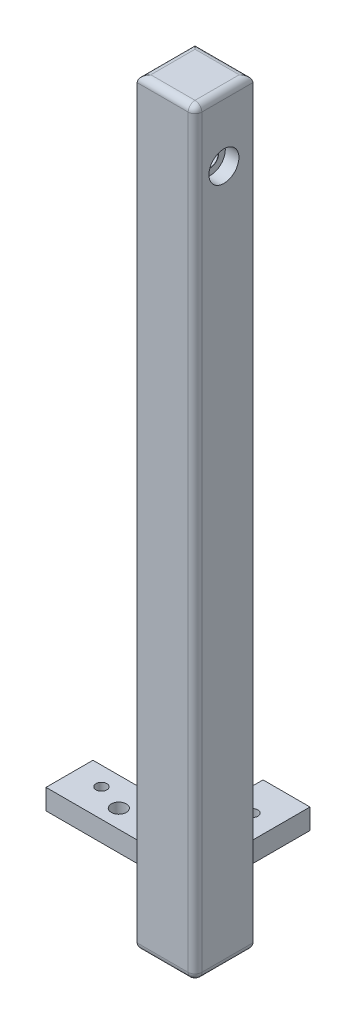
ISO-10303-21;
HEADER;
FILE_DESCRIPTION(('STEP AP214'),'2;1');
FILE_NAME('part.step','',(''),(''),'','','');
FILE_SCHEMA(('AUTOMOTIVE_DESIGN { 1 0 10303 214 1 1 1 1 }'));
ENDSEC;
DATA;
#1=APPLICATION_CONTEXT('core data for automotive mechanical design processes');
#2=APPLICATION_PROTOCOL_DEFINITION('international standard','automotive_design',2000,#1);
#3=PRODUCT_CONTEXT('',#1,'mechanical');
#4=PRODUCT('Part','Part','',(#3));
#5=PRODUCT_RELATED_PRODUCT_CATEGORY('part','',(#4));
#6=PRODUCT_DEFINITION_FORMATION('','',#4);
#7=PRODUCT_DEFINITION_CONTEXT('part definition',#1,'design');
#8=PRODUCT_DEFINITION('design','',#6,#7);
#9=PRODUCT_DEFINITION_SHAPE('','',#8);
#10=(LENGTH_UNIT() NAMED_UNIT(*) SI_UNIT(.MILLI.,.METRE.));
#11=(NAMED_UNIT(*) PLANE_ANGLE_UNIT() SI_UNIT($,.RADIAN.));
#12=(NAMED_UNIT(*) SI_UNIT($,.STERADIAN.) SOLID_ANGLE_UNIT());
#13=UNCERTAINTY_MEASURE_WITH_UNIT(LENGTH_MEASURE(1.E-05),#10,'distance_accuracy_value','');
#14=(GEOMETRIC_REPRESENTATION_CONTEXT(3) GLOBAL_UNCERTAINTY_ASSIGNED_CONTEXT((#13)) GLOBAL_UNIT_ASSIGNED_CONTEXT((#10,
#11,#12)) REPRESENTATION_CONTEXT('',''));
#15=CARTESIAN_POINT('',(0.,0.,0.));
#16=DIRECTION('',(0.,0.,1.));
#17=DIRECTION('',(1.,0.,0.));
#18=AXIS2_PLACEMENT_3D('',#15,#16,#17);
#19=CARTESIAN_POINT('',(0.,0.,0.));
#20=DIRECTION('',(0.,0.,1.));
#21=DIRECTION('',(1.,0.,0.));
#22=AXIS2_PLACEMENT_3D('',#19,#20,#21);
#23=PLANE('',#22);
#24=DIRECTION('',(0.,1.,0.));
#25=VECTOR('',#24,1.);
#26=CARTESIAN_POINT('',(0.,-99.,0.));
#27=LINE('',#26,#25);
#28=CARTESIAN_POINT('',(0.,-102.,0.));
#29=VERTEX_POINT('',#28);
#30=CARTESIAN_POINT('',(0.,-98.9999999999999,0.));
#31=VERTEX_POINT('',#30);
#32=EDGE_CURVE('E232',#29,#31,#27,.T.);
#33=ORIENTED_EDGE('',*,*,#32,.F.);
#34=DIRECTION('',(1.,0.,0.));
#35=VECTOR('',#34,1.);
#36=CARTESIAN_POINT('',(-15.,-102.,0.));
#37=LINE('',#36,#35);
#38=CARTESIAN_POINT('',(-15.,-102.,0.));
#39=VERTEX_POINT('',#38);
#40=EDGE_CURVE('E206',#39,#29,#37,.T.);
#41=ORIENTED_EDGE('',*,*,#40,.F.);
#42=DIRECTION('',(0.,-1.,0.));
#43=VECTOR('',#42,1.);
#44=CARTESIAN_POINT('',(-15.,-99.,0.));
#45=LINE('',#44,#43);
#46=CARTESIAN_POINT('',(-15.,-99.,0.));
#47=VERTEX_POINT('',#46);
#48=EDGE_CURVE('E188',#47,#39,#45,.T.);
#49=ORIENTED_EDGE('',*,*,#48,.F.);
#50=DIRECTION('',(1.,0.,0.));
#51=VECTOR('',#50,1.);
#52=CARTESIAN_POINT('',(-15.,-99.,0.));
#53=LINE('',#52,#51);
#54=EDGE_CURVE('E384',#47,#31,#53,.T.);
#55=ORIENTED_EDGE('',*,*,#54,.T.);
#56=EDGE_LOOP('',(#33,#41,#49,#55));
#57=FACE_BOUND('',#56,.T.);
#58=ADVANCED_FACE('F40',(#57),#23,.F.);
#59=CARTESIAN_POINT('',(3.45000000000001,-26.8,0.));
#60=DIRECTION('',(0.,0.,-1.));
#61=DIRECTION('',(-1.,0.,0.));
#62=AXIS2_PLACEMENT_3D('',#59,#60,#61);
#63=CIRCLE('',#62,0.999999999999989);
#64=CARTESIAN_POINT('',(2.45000000000002,-26.8,0.));
#65=VERTEX_POINT('',#64);
#66=EDGE_CURVE('E444',#65,#65,#63,.T.);
#67=ORIENTED_EDGE('',*,*,#66,.F.);
#68=EDGE_LOOP('',(#67));
#69=FACE_BOUND('',#68,.T.);
#70=CARTESIAN_POINT('',(3.45000000000001,-84.2,0.));
#71=DIRECTION('',(0.,0.,-1.));
#72=DIRECTION('',(-1.,0.,0.));
#73=AXIS2_PLACEMENT_3D('',#70,#71,#72);
#74=CIRCLE('',#73,0.999999999999989);
#75=CARTESIAN_POINT('',(2.45000000000002,-84.2,0.));
#76=VERTEX_POINT('',#75);
#77=EDGE_CURVE('E450',#76,#76,#74,.T.);
#78=ORIENTED_EDGE('',*,*,#77,.F.);
#79=EDGE_LOOP('',(#78));
#80=FACE_BOUND('',#79,.T.);
#81=CARTESIAN_POINT('',(3.45,-31.1,0.));
#82=DIRECTION('',(0.,0.,-1.));
#83=DIRECTION('',(-1.,0.,0.));
#84=AXIS2_PLACEMENT_3D('',#81,#82,#83);
#85=CIRCLE('',#84,0.999999999999989);
#86=CARTESIAN_POINT('',(2.45000000000002,-31.1,0.));
#87=VERTEX_POINT('',#86);
#88=EDGE_CURVE('E456',#87,#87,#85,.T.);
#89=ORIENTED_EDGE('',*,*,#88,.F.);
#90=EDGE_LOOP('',(#89));
#91=FACE_BOUND('',#90,.T.);
#92=CARTESIAN_POINT('',(3.45000000000001,-79.9,0.));
#93=DIRECTION('',(0.,0.,-1.));
#94=DIRECTION('',(-1.,0.,0.));
#95=AXIS2_PLACEMENT_3D('',#92,#93,#94);
#96=CIRCLE('',#95,0.999999999999989);
#97=CARTESIAN_POINT('',(2.45000000000002,-79.9,0.));
#98=VERTEX_POINT('',#97);
#99=EDGE_CURVE('E462',#98,#98,#96,.T.);
#100=ORIENTED_EDGE('',*,*,#99,.F.);
#101=EDGE_LOOP('',(#100));
#102=FACE_BOUND('',#101,.T.);
#103=DIRECTION('',(0.,-1.,0.));
#104=VECTOR('',#103,1.);
#105=CARTESIAN_POINT('',(0.,0.,0.));
#106=LINE('',#105,#104);
#107=CARTESIAN_POINT('',(0.,-1.,0.));
#108=VERTEX_POINT('',#107);
#109=EDGE_CURVE('E186',#108,#31,#106,.T.);
#110=ORIENTED_EDGE('',*,*,#109,.F.);
#111=DIRECTION('',(-1.,0.,0.));
#112=VECTOR('',#111,1.);
#113=CARTESIAN_POINT('',(0.,-1.,0.));
#114=LINE('',#113,#112);
#115=CARTESIAN_POINT('',(8.50000000000001,-1.,0.));
#116=VERTEX_POINT('',#115);
#117=EDGE_CURVE('E248',#108,#116,#114,.F.);
#118=ORIENTED_EDGE('',*,*,#117,.T.);
#119=DIRECTION('',(0.,-1.,0.));
#120=VECTOR('',#119,1.);
#121=CARTESIAN_POINT('',(8.50000000000001,0.,0.));
#122=LINE('',#121,#120);
#123=CARTESIAN_POINT('',(8.50000000000001,-110.5,0.));
#124=VERTEX_POINT('',#123);
#125=EDGE_CURVE('E215',#116,#124,#122,.T.);
#126=ORIENTED_EDGE('',*,*,#125,.T.);
#127=DIRECTION('',(1.,0.,0.));
#128=VECTOR('',#127,1.);
#129=CARTESIAN_POINT('',(0.,-110.5,0.));
#130=LINE('',#129,#128);
#131=CARTESIAN_POINT('',(0.,-110.5,0.));
#132=VERTEX_POINT('',#131);
#133=EDGE_CURVE('E302',#124,#132,#130,.F.);
#134=ORIENTED_EDGE('',*,*,#133,.T.);
#135=EDGE_CURVE('E224',#29,#132,#106,.T.);
#136=ORIENTED_EDGE('',*,*,#135,.F.);
#137=DIRECTION('',(-1.,0.,0.));
#138=VECTOR('',#137,1.);
#139=CARTESIAN_POINT('',(0.,-102.,0.));
#140=LINE('',#139,#138);
#141=CARTESIAN_POINT('',(6.90000000000001,-102.,0.));
#142=VERTEX_POINT('',#141);
#143=EDGE_CURVE('E231',#142,#29,#140,.T.);
#144=ORIENTED_EDGE('',*,*,#143,.F.);
#145=DIRECTION('',(0.,1.,0.));
#146=VECTOR('',#145,1.);
#147=CARTESIAN_POINT('',(6.90000000000001,-109.,0.));
#148=LINE('',#147,#146);
#149=CARTESIAN_POINT('',(6.90000000000001,-99.,0.));
#150=VERTEX_POINT('',#149);
#151=EDGE_CURVE('E434',#142,#150,#148,.T.);
#152=ORIENTED_EDGE('',*,*,#151,.T.);
#153=DIRECTION('',(1.,0.,0.));
#154=VECTOR('',#153,1.);
#155=CARTESIAN_POINT('',(0.,-99.,0.));
#156=LINE('',#155,#154);
#157=EDGE_CURVE('E227',#31,#150,#156,.T.);
#158=ORIENTED_EDGE('',*,*,#157,.F.);
#159=EDGE_LOOP('',(#110,#118,#126,#134,#136,#144,#152,#158));
#160=FACE_BOUND('',#159,.T.);
#161=ADVANCED_FACE('F395',(#69,#80,#91,#102,#160),#23,.F.);
#162=CARTESIAN_POINT('',(0.,0.,8.5));
#163=DIRECTION('',(1.,0.,0.));
#164=DIRECTION('',(0.,1.,0.));
#165=AXIS2_PLACEMENT_3D('',#162,#163,#164);
#166=PLANE('',#165);
#167=DIRECTION('',(0.,1.,0.));
#168=VECTOR('',#167,1.);
#169=CARTESIAN_POINT('',(0.,-109.,6.9));
#170=LINE('',#169,#168);
#171=CARTESIAN_POINT('',(0.,-102.,6.9));
#172=VERTEX_POINT('',#171);
#173=CARTESIAN_POINT('',(0.,-99.,6.9));
#174=VERTEX_POINT('',#173);
#175=EDGE_CURVE('E167',#172,#174,#170,.T.);
#176=ORIENTED_EDGE('',*,*,#175,.F.);
#177=DIRECTION('',(0.,0.,1.));
#178=VECTOR('',#177,1.);
#179=CARTESIAN_POINT('',(0.,-102.,0.));
#180=LINE('',#179,#178);
#181=EDGE_CURVE('E189',#29,#172,#180,.T.);
#182=ORIENTED_EDGE('',*,*,#181,.F.);
#183=ORIENTED_EDGE('',*,*,#135,.T.);
#184=DIRECTION('',(0.,0.,-1.));
#185=VECTOR('',#184,1.);
#186=CARTESIAN_POINT('',(0.,-110.5,8.5));
#187=LINE('',#186,#185);
#188=CARTESIAN_POINT('',(0.,-110.5,8.5));
#189=VERTEX_POINT('',#188);
#190=EDGE_CURVE('E318',#132,#189,#187,.F.);
#191=ORIENTED_EDGE('',*,*,#190,.T.);
#192=DIRECTION('',(0.,-1.,0.));
#193=VECTOR('',#192,1.);
#194=CARTESIAN_POINT('',(0.,0.,8.5));
#195=LINE('',#194,#193);
#196=CARTESIAN_POINT('',(0.,-1.,8.5));
#197=VERTEX_POINT('',#196);
#198=EDGE_CURVE('E203',#197,#189,#195,.T.);
#199=ORIENTED_EDGE('',*,*,#198,.F.);
#200=DIRECTION('',(0.,0.,-1.));
#201=VECTOR('',#200,1.);
#202=CARTESIAN_POINT('',(0.,-1.,8.5));
#203=LINE('',#202,#201);
#204=EDGE_CURVE('E287',#197,#108,#203,.T.);
#205=ORIENTED_EDGE('',*,*,#204,.T.);
#206=ORIENTED_EDGE('',*,*,#109,.T.);
#207=DIRECTION('',(0.,0.,-1.));
#208=VECTOR('',#207,1.);
#209=CARTESIAN_POINT('',(0.,-99.,0.));
#210=LINE('',#209,#208);
#211=EDGE_CURVE('E44',#174,#31,#210,.T.);
#212=ORIENTED_EDGE('',*,*,#211,.F.);
#213=EDGE_LOOP('',(#176,#182,#183,#191,#199,#205,#206,#212));
#214=FACE_BOUND('',#213,.T.);
#215=CARTESIAN_POINT('',(0.,-9.5,4.25));
#216=DIRECTION('',(1.,0.,0.));
#217=DIRECTION('',(0.,1.,0.));
#218=AXIS2_PLACEMENT_3D('',#215,#216,#217);
#219=CIRCLE('',#218,1.2);
#220=CARTESIAN_POINT('',(0.,-8.3,4.25));
#221=VERTEX_POINT('',#220);
#222=EDGE_CURVE('E333',#221,#221,#219,.T.);
#223=ORIENTED_EDGE('',*,*,#222,.T.);
#224=EDGE_LOOP('',(#223));
#225=FACE_BOUND('',#224,.T.);
#226=ADVANCED_FACE('F183',(#214,#225),#166,.F.);
#227=CARTESIAN_POINT('',(8.50000000000001,0.,8.5));
#228=DIRECTION('',(1.,0.,0.));
#229=DIRECTION('',(0.,1.,0.));
#230=AXIS2_PLACEMENT_3D('',#227,#228,#229);
#231=PLANE('',#230);
#232=ORIENTED_EDGE('',*,*,#125,.F.);
#233=DIRECTION('',(0.,0.,-1.));
#234=VECTOR('',#233,1.);
#235=CARTESIAN_POINT('',(8.50000000000001,-1.,8.5));
#236=LINE('',#235,#234);
#237=CARTESIAN_POINT('',(8.50000000000001,-1.,7.5));
#238=VERTEX_POINT('',#237);
#239=EDGE_CURVE('E307',#116,#238,#236,.F.);
#240=ORIENTED_EDGE('',*,*,#239,.T.);
#241=DIRECTION('',(0.,-1.,0.));
#242=VECTOR('',#241,1.);
#243=CARTESIAN_POINT('',(8.50000000000001,0.,7.5));
#244=LINE('',#243,#242);
#245=CARTESIAN_POINT('',(8.50000000000001,-110.5,7.5));
#246=VERTEX_POINT('',#245);
#247=EDGE_CURVE('E309',#238,#246,#244,.T.);
#248=ORIENTED_EDGE('',*,*,#247,.T.);
#249=DIRECTION('',(0.,0.,-1.));
#250=VECTOR('',#249,1.);
#251=CARTESIAN_POINT('',(8.50000000000001,-110.5,0.));
#252=LINE('',#251,#250);
#253=EDGE_CURVE('E304',#246,#124,#252,.T.);
#254=ORIENTED_EDGE('',*,*,#253,.T.);
#255=EDGE_LOOP('',(#232,#240,#248,#254));
#256=FACE_BOUND('',#255,.T.);
#257=CARTESIAN_POINT('',(8.50000000000001,-9.5,4.25));
#258=DIRECTION('',(1.,0.,0.));
#259=DIRECTION('',(0.,0.,-1.));
#260=AXIS2_PLACEMENT_3D('',#257,#258,#259);
#261=CIRCLE('',#260,2.2);
#262=CARTESIAN_POINT('',(8.50000000000001,-9.5,2.05));
#263=VERTEX_POINT('',#262);
#264=EDGE_CURVE('E252',#263,#263,#261,.T.);
#265=ORIENTED_EDGE('',*,*,#264,.F.);
#266=EDGE_LOOP('',(#265));
#267=FACE_BOUND('',#266,.T.);
#268=ADVANCED_FACE('F498',(#256,#267),#231,.T.);
#269=CARTESIAN_POINT('',(8.50000000000001,0.,8.5));
#270=DIRECTION('',(0.,-1.,0.));
#271=DIRECTION('',(1.,0.,0.));
#272=AXIS2_PLACEMENT_3D('',#269,#270,#271);
#273=PLANE('',#272);
#274=DIRECTION('',(-1.,0.,0.));
#275=VECTOR('',#274,1.);
#276=CARTESIAN_POINT('',(8.50000000000001,0.,7.5));
#277=LINE('',#276,#275);
#278=CARTESIAN_POINT('',(1.,0.,7.5));
#279=VERTEX_POINT('',#278);
#280=CARTESIAN_POINT('',(7.50000000000001,0.,7.5));
#281=VERTEX_POINT('',#280);
#282=EDGE_CURVE('E293',#279,#281,#277,.F.);
#283=ORIENTED_EDGE('',*,*,#282,.T.);
#284=DIRECTION('',(0.,0.,-1.));
#285=VECTOR('',#284,1.);
#286=CARTESIAN_POINT('',(7.50000000000001,0.,0.));
#287=LINE('',#286,#285);
#288=CARTESIAN_POINT('',(7.50000000000001,0.,1.));
#289=VERTEX_POINT('',#288);
#290=EDGE_CURVE('E289',#281,#289,#287,.T.);
#291=ORIENTED_EDGE('',*,*,#290,.T.);
#292=DIRECTION('',(-1.,0.,0.));
#293=VECTOR('',#292,1.);
#294=CARTESIAN_POINT('',(8.50000000000001,0.,1.));
#295=LINE('',#294,#293);
#296=CARTESIAN_POINT('',(1.,0.,1.));
#297=VERTEX_POINT('',#296);
#298=EDGE_CURVE('E297',#289,#297,#295,.T.);
#299=ORIENTED_EDGE('',*,*,#298,.T.);
#300=DIRECTION('',(0.,0.,-1.));
#301=VECTOR('',#300,1.);
#302=CARTESIAN_POINT('',(1.,0.,8.5));
#303=LINE('',#302,#301);
#304=EDGE_CURVE('E295',#297,#279,#303,.F.);
#305=ORIENTED_EDGE('',*,*,#304,.T.);
#306=EDGE_LOOP('',(#283,#291,#299,#305));
#307=FACE_BOUND('',#306,.T.);
#308=ADVANCED_FACE('F424',(#307),#273,.F.);
#309=CARTESIAN_POINT('',(0.,-111.5,8.5));
#310=DIRECTION('',(0.,1.,0.));
#311=DIRECTION('',(0.,0.,1.));
#312=AXIS2_PLACEMENT_3D('',#309,#310,#311);
#313=PLANE('',#312);
#314=DIRECTION('',(1.,0.,0.));
#315=VECTOR('',#314,1.);
#316=CARTESIAN_POINT('',(0.,-111.5,7.5));
#317=LINE('',#316,#315);
#318=CARTESIAN_POINT('',(7.50000000000001,-111.5,7.5));
#319=VERTEX_POINT('',#318);
#320=CARTESIAN_POINT('',(1.00000000000001,-111.5,7.5));
#321=VERTEX_POINT('',#320);
#322=EDGE_CURVE('E324',#319,#321,#317,.F.);
#323=ORIENTED_EDGE('',*,*,#322,.T.);
#324=DIRECTION('',(0.,0.,-1.));
#325=VECTOR('',#324,1.);
#326=CARTESIAN_POINT('',(1.00000000000001,-111.5,8.5));
#327=LINE('',#326,#325);
#328=CARTESIAN_POINT('',(1.00000000000001,-111.5,1.));
#329=VERTEX_POINT('',#328);
#330=EDGE_CURVE('E321',#321,#329,#327,.T.);
#331=ORIENTED_EDGE('',*,*,#330,.T.);
#332=DIRECTION('',(1.,0.,0.));
#333=VECTOR('',#332,1.);
#334=CARTESIAN_POINT('',(0.,-111.5,1.));
#335=LINE('',#334,#333);
#336=CARTESIAN_POINT('',(7.50000000000001,-111.5,1.));
#337=VERTEX_POINT('',#336);
#338=EDGE_CURVE('E328',#329,#337,#335,.T.);
#339=ORIENTED_EDGE('',*,*,#338,.T.);
#340=DIRECTION('',(0.,0.,-1.));
#341=VECTOR('',#340,1.);
#342=CARTESIAN_POINT('',(7.50000000000001,-111.5,8.5));
#343=LINE('',#342,#341);
#344=EDGE_CURVE('E326',#337,#319,#343,.F.);
#345=ORIENTED_EDGE('',*,*,#344,.T.);
#346=EDGE_LOOP('',(#323,#331,#339,#345));
#347=FACE_BOUND('',#346,.T.);
#348=CARTESIAN_POINT('',(4.25000000000001,-111.5,4.25));
#349=DIRECTION('',(0.,1.,0.));
#350=DIRECTION('',(0.,0.,1.));
#351=AXIS2_PLACEMENT_3D('',#348,#349,#350);
#352=CIRCLE('',#351,3.09999999999999);
#353=CARTESIAN_POINT('',(4.25000000000001,-111.5,7.34999999999999));
#354=VERTEX_POINT('',#353);
#355=EDGE_CURVE('E330',#354,#354,#352,.T.);
#356=ORIENTED_EDGE('',*,*,#355,.T.);
#357=EDGE_LOOP('',(#356));
#358=FACE_BOUND('',#357,.T.);
#359=ADVANCED_FACE('F506',(#347,#358),#313,.F.);
#360=CARTESIAN_POINT('',(0.,0.,8.5));
#361=DIRECTION('',(0.,0.,1.));
#362=DIRECTION('',(1.,0.,0.));
#363=AXIS2_PLACEMENT_3D('',#360,#361,#362);
#364=PLANE('',#363);
#365=DIRECTION('',(-1.,0.,0.));
#366=VECTOR('',#365,1.);
#367=CARTESIAN_POINT('',(0.,-1.,8.5));
#368=LINE('',#367,#366);
#369=CARTESIAN_POINT('',(7.50000000000001,-1.,8.5));
#370=VERTEX_POINT('',#369);
#371=EDGE_CURVE('E313',#370,#197,#368,.T.);
#372=ORIENTED_EDGE('',*,*,#371,.T.);
#373=ORIENTED_EDGE('',*,*,#198,.T.);
#374=DIRECTION('',(1.,0.,0.));
#375=VECTOR('',#374,1.);
#376=CARTESIAN_POINT('',(8.50000000000001,-110.5,8.5));
#377=LINE('',#376,#375);
#378=CARTESIAN_POINT('',(7.50000000000001,-110.5,8.5));
#379=VERTEX_POINT('',#378);
#380=EDGE_CURVE('E311',#189,#379,#377,.T.);
#381=ORIENTED_EDGE('',*,*,#380,.T.);
#382=DIRECTION('',(0.,-1.,0.));
#383=VECTOR('',#382,1.);
#384=CARTESIAN_POINT('',(7.50000000000001,0.,8.5));
#385=LINE('',#384,#383);
#386=EDGE_CURVE('E316',#379,#370,#385,.F.);
#387=ORIENTED_EDGE('',*,*,#386,.T.);
#388=EDGE_LOOP('',(#372,#373,#381,#387));
#389=FACE_BOUND('',#388,.T.);
#390=ADVANCED_FACE('F410',(#389),#364,.T.);
#391=CARTESIAN_POINT('',(4.25000000000001,-91.5,4.25));
#392=DIRECTION('',(0.,-1.,0.));
#393=DIRECTION('',(0.,0.,-1.));
#394=AXIS2_PLACEMENT_3D('',#391,#392,#393);
#395=CONICAL_SURFACE('',#394,2.1,1.02974425867666);
#396=CARTESIAN_POINT('',(4.25000000000001,-90.2381927000421,4.25));
#397=VERTEX_POINT('',#396);
#398=VERTEX_LOOP('',#397);
#399=FACE_BOUND('',#398,.T.);
#400=CARTESIAN_POINT('',(4.25000000000001,-91.5,4.25));
#401=DIRECTION('',(0.,-1.,0.));
#402=DIRECTION('',(0.,0.,-1.));
#403=AXIS2_PLACEMENT_3D('',#400,#401,#402);
#404=CIRCLE('',#403,2.1);
#405=CARTESIAN_POINT('',(4.25000000000001,-91.5,2.15));
#406=VERTEX_POINT('',#405);
#407=EDGE_CURVE('E213',#406,#406,#404,.T.);
#408=ORIENTED_EDGE('',*,*,#407,.T.);
#409=EDGE_LOOP('',(#408));
#410=FACE_BOUND('',#409,.T.);
#411=ADVANCED_FACE('F524',(#399,#410),#395,.F.);
#412=CARTESIAN_POINT('',(4.25000000000001,-111.5,4.25));
#413=DIRECTION('',(0.,-1.,0.));
#414=DIRECTION('',(0.,0.,-1.));
#415=AXIS2_PLACEMENT_3D('',#412,#413,#414);
#416=CYLINDRICAL_SURFACE('',#415,2.09999999999999);
#417=CARTESIAN_POINT('',(4.25000000000001,-110.5,4.25));
#418=DIRECTION('',(0.,1.,0.));
#419=DIRECTION('',(0.,0.,1.));
#420=AXIS2_PLACEMENT_3D('',#417,#418,#419);
#421=CIRCLE('',#420,2.09999999999999);
#422=CARTESIAN_POINT('',(4.25000000000001,-110.5,6.34999999999999));
#423=VERTEX_POINT('',#422);
#424=EDGE_CURVE('E299',#423,#423,#421,.F.);
#425=ORIENTED_EDGE('',*,*,#424,.T.);
#426=EDGE_LOOP('',(#425));
#427=FACE_BOUND('',#426,.T.);
#428=ORIENTED_EDGE('',*,*,#407,.F.);
#429=EDGE_LOOP('',(#428));
#430=FACE_BOUND('',#429,.T.);
#431=ADVANCED_FACE('F534',(#427,#430),#416,.F.);
#432=CARTESIAN_POINT('',(-15.,-102.,0.));
#433=DIRECTION('',(0.,1.,0.));
#434=DIRECTION('',(-1.,0.,0.));
#435=AXIS2_PLACEMENT_3D('',#432,#433,#434);
#436=PLANE('',#435);
#437=CARTESIAN_POINT('',(-11.,-102.,2.75));
#438=DIRECTION('',(0.,1.,0.));
#439=DIRECTION('',(-1.,0.,0.));
#440=AXIS2_PLACEMENT_3D('',#437,#438,#439);
#441=CIRCLE('',#440,0.799999999999999);
#442=CARTESIAN_POINT('',(-11.8,-102.,2.75));
#443=VERTEX_POINT('',#442);
#444=EDGE_CURVE('E374',#443,#443,#441,.T.);
#445=ORIENTED_EDGE('',*,*,#444,.T.);
#446=EDGE_LOOP('',(#445));
#447=FACE_BOUND('',#446,.T.);
#448=CARTESIAN_POINT('',(-6.99999999999999,-102.,4.2));
#449=DIRECTION('',(0.,1.,0.));
#450=DIRECTION('',(-1.,0.,0.));
#451=AXIS2_PLACEMENT_3D('',#448,#449,#450);
#452=CIRCLE('',#451,1.09999999999999);
#453=CARTESIAN_POINT('',(-8.09999999999997,-102.,4.2));
#454=VERTEX_POINT('',#453);
#455=EDGE_CURVE('E193',#454,#454,#452,.T.);
#456=ORIENTED_EDGE('',*,*,#455,.T.);
#457=EDGE_LOOP('',(#456));
#458=FACE_BOUND('',#457,.T.);
#459=ORIENTED_EDGE('',*,*,#181,.T.);
#460=DIRECTION('',(-1.,0.,0.));
#461=VECTOR('',#460,1.);
#462=CARTESIAN_POINT('',(-15.,-102.,6.9));
#463=LINE('',#462,#461);
#464=CARTESIAN_POINT('',(-15.,-102.,6.9));
#465=VERTEX_POINT('',#464);
#466=EDGE_CURVE('E170',#172,#465,#463,.T.);
#467=ORIENTED_EDGE('',*,*,#466,.T.);
#468=DIRECTION('',(0.,0.,1.));
#469=VECTOR('',#468,1.);
#470=CARTESIAN_POINT('',(-15.,-102.,0.));
#471=LINE('',#470,#469);
#472=EDGE_CURVE('E191',#39,#465,#471,.T.);
#473=ORIENTED_EDGE('',*,*,#472,.F.);
#474=ORIENTED_EDGE('',*,*,#40,.T.);
#475=EDGE_LOOP('',(#459,#467,#473,#474));
#476=FACE_BOUND('',#475,.T.);
#477=ADVANCED_FACE('F390',(#447,#458,#476),#436,.F.);
#478=CARTESIAN_POINT('',(-15.,-99.,0.));
#479=DIRECTION('',(0.,-1.,0.));
#480=DIRECTION('',(1.,0.,0.));
#481=AXIS2_PLACEMENT_3D('',#478,#479,#480);
#482=PLANE('',#481);
#483=CARTESIAN_POINT('',(-11.,-99.,2.75));
#484=DIRECTION('',(0.,1.,0.));
#485=DIRECTION('',(0.,0.,1.));
#486=AXIS2_PLACEMENT_3D('',#483,#484,#485);
#487=CIRCLE('',#486,0.799999999999999);
#488=CARTESIAN_POINT('',(-11.,-99.,3.55));
#489=VERTEX_POINT('',#488);
#490=EDGE_CURVE('E242',#489,#489,#487,.T.);
#491=ORIENTED_EDGE('',*,*,#490,.F.);
#492=EDGE_LOOP('',(#491));
#493=FACE_BOUND('',#492,.T.);
#494=CARTESIAN_POINT('',(-6.99999999999999,-99.,4.2));
#495=DIRECTION('',(0.,1.,0.));
#496=DIRECTION('',(0.,0.,1.));
#497=AXIS2_PLACEMENT_3D('',#494,#495,#496);
#498=CIRCLE('',#497,1.09999999999999);
#499=CARTESIAN_POINT('',(-6.99999999999999,-99.,5.29999999999999));
#500=VERTEX_POINT('',#499);
#501=EDGE_CURVE('E198',#500,#500,#498,.T.);
#502=ORIENTED_EDGE('',*,*,#501,.F.);
#503=EDGE_LOOP('',(#502));
#504=FACE_BOUND('',#503,.T.);
#505=DIRECTION('',(0.,0.,-1.));
#506=VECTOR('',#505,1.);
#507=CARTESIAN_POINT('',(-15.,-99.,0.));
#508=LINE('',#507,#506);
#509=CARTESIAN_POINT('',(-15.,-99.,6.9));
#510=VERTEX_POINT('',#509);
#511=EDGE_CURVE('E181',#510,#47,#508,.T.);
#512=ORIENTED_EDGE('',*,*,#511,.F.);
#513=DIRECTION('',(-1.,0.,0.));
#514=VECTOR('',#513,1.);
#515=CARTESIAN_POINT('',(-15.,-99.,6.9));
#516=LINE('',#515,#514);
#517=EDGE_CURVE('E56',#174,#510,#516,.T.);
#518=ORIENTED_EDGE('',*,*,#517,.F.);
#519=ORIENTED_EDGE('',*,*,#211,.T.);
#520=ORIENTED_EDGE('',*,*,#54,.F.);
#521=EDGE_LOOP('',(#512,#518,#519,#520));
#522=FACE_BOUND('',#521,.T.);
#523=ADVANCED_FACE('F178',(#493,#504,#522),#482,.F.);
#524=CARTESIAN_POINT('',(-15.,0.,0.));
#525=DIRECTION('',(-1.,0.,0.));
#526=DIRECTION('',(0.,-1.,0.));
#527=AXIS2_PLACEMENT_3D('',#524,#525,#526);
#528=PLANE('',#527);
#529=DIRECTION('',(0.,-1.,0.));
#530=VECTOR('',#529,1.);
#531=CARTESIAN_POINT('',(-15.,0.,6.9));
#532=LINE('',#531,#530);
#533=EDGE_CURVE('E11',#510,#465,#532,.T.);
#534=ORIENTED_EDGE('',*,*,#533,.F.);
#535=ORIENTED_EDGE('',*,*,#511,.T.);
#536=ORIENTED_EDGE('',*,*,#48,.T.);
#537=ORIENTED_EDGE('',*,*,#472,.T.);
#538=EDGE_LOOP('',(#534,#535,#536,#537));
#539=FACE_BOUND('',#538,.T.);
#540=ADVANCED_FACE('F549',(#539),#528,.T.);
#541=CARTESIAN_POINT('',(-6.99999999999999,-99.,4.2));
#542=DIRECTION('',(0.,1.,0.));
#543=DIRECTION('',(0.,0.,1.));
#544=AXIS2_PLACEMENT_3D('',#541,#542,#543);
#545=CYLINDRICAL_SURFACE('',#544,1.09999999999999);
#546=ORIENTED_EDGE('',*,*,#501,.T.);
#547=EDGE_LOOP('',(#546));
#548=FACE_BOUND('',#547,.T.);
#549=ORIENTED_EDGE('',*,*,#455,.F.);
#550=EDGE_LOOP('',(#549));
#551=FACE_BOUND('',#550,.T.);
#552=ADVANCED_FACE('F553',(#548,#551),#545,.F.);
#553=CARTESIAN_POINT('',(-11.,-99.,2.75));
#554=DIRECTION('',(0.,1.,0.));
#555=DIRECTION('',(0.,0.,1.));
#556=AXIS2_PLACEMENT_3D('',#553,#554,#555);
#557=CYLINDRICAL_SURFACE('',#556,0.799999999999999);
#558=ORIENTED_EDGE('',*,*,#444,.F.);
#559=EDGE_LOOP('',(#558));
#560=FACE_BOUND('',#559,.T.);
#561=ORIENTED_EDGE('',*,*,#490,.T.);
#562=EDGE_LOOP('',(#561));
#563=FACE_BOUND('',#562,.T.);
#564=ADVANCED_FACE('F556',(#560,#563),#557,.F.);
#565=CARTESIAN_POINT('',(0.,-99.,-10.));
#566=DIRECTION('',(1.,0.,0.));
#567=DIRECTION('',(0.,1.,0.));
#568=AXIS2_PLACEMENT_3D('',#565,#566,#567);
#569=PLANE('',#568);
#570=ORIENTED_EDGE('',*,*,#32,.T.);
#571=DIRECTION('',(0.,0.,1.));
#572=VECTOR('',#571,1.);
#573=CARTESIAN_POINT('',(0.,-99.,-10.));
#574=LINE('',#573,#572);
#575=CARTESIAN_POINT('',(0.,-99.,-10.));
#576=VERTEX_POINT('',#575);
#577=EDGE_CURVE('E233',#576,#31,#574,.T.);
#578=ORIENTED_EDGE('',*,*,#577,.F.);
#579=DIRECTION('',(0.,1.,0.));
#580=VECTOR('',#579,1.);
#581=CARTESIAN_POINT('',(0.,-99.,-10.));
#582=LINE('',#581,#580);
#583=CARTESIAN_POINT('',(0.,-102.,-10.));
#584=VERTEX_POINT('',#583);
#585=EDGE_CURVE('E246',#584,#576,#582,.T.);
#586=ORIENTED_EDGE('',*,*,#585,.F.);
#587=DIRECTION('',(0.,0.,1.));
#588=VECTOR('',#587,1.);
#589=CARTESIAN_POINT('',(0.,-102.,-10.));
#590=LINE('',#589,#588);
#591=EDGE_CURVE('E340',#584,#29,#590,.T.);
#592=ORIENTED_EDGE('',*,*,#591,.T.);
#593=EDGE_LOOP('',(#570,#578,#586,#592));
#594=FACE_BOUND('',#593,.T.);
#595=ADVANCED_FACE('F370',(#594),#569,.F.);
#596=CARTESIAN_POINT('',(0.,-99.,-10.));
#597=DIRECTION('',(0.,-1.,0.));
#598=DIRECTION('',(0.,0.,-1.));
#599=AXIS2_PLACEMENT_3D('',#596,#597,#598);
#600=PLANE('',#599);
#601=CARTESIAN_POINT('',(3.45,-99.,-5.));
#602=DIRECTION('',(0.,1.,0.));
#603=DIRECTION('',(0.,0.,1.));
#604=AXIS2_PLACEMENT_3D('',#601,#602,#603);
#605=CIRCLE('',#604,0.799999999999999);
#606=CARTESIAN_POINT('',(3.45,-99.,-4.2));
#607=VERTEX_POINT('',#606);
#608=EDGE_CURVE('E336',#607,#607,#605,.T.);
#609=ORIENTED_EDGE('',*,*,#608,.F.);
#610=EDGE_LOOP('',(#609));
#611=FACE_BOUND('',#610,.T.);
#612=ORIENTED_EDGE('',*,*,#157,.T.);
#613=DIRECTION('',(0.,0.,1.));
#614=VECTOR('',#613,1.);
#615=CARTESIAN_POINT('',(6.90000000000001,-99.,0.));
#616=LINE('',#615,#614);
#617=CARTESIAN_POINT('',(6.90000000000001,-99.,-10.));
#618=VERTEX_POINT('',#617);
#619=EDGE_CURVE('E438',#618,#150,#616,.T.);
#620=ORIENTED_EDGE('',*,*,#619,.F.);
#621=DIRECTION('',(1.,0.,0.));
#622=VECTOR('',#621,1.);
#623=CARTESIAN_POINT('',(0.,-99.,-10.));
#624=LINE('',#623,#622);
#625=EDGE_CURVE('E360',#576,#618,#624,.T.);
#626=ORIENTED_EDGE('',*,*,#625,.F.);
#627=ORIENTED_EDGE('',*,*,#577,.T.);
#628=EDGE_LOOP('',(#612,#620,#626,#627));
#629=FACE_BOUND('',#628,.T.);
#630=ADVANCED_FACE('F437',(#611,#629),#600,.F.);
#631=CARTESIAN_POINT('',(0.,-102.,-10.));
#632=DIRECTION('',(0.,1.,0.));
#633=DIRECTION('',(0.,0.,1.));
#634=AXIS2_PLACEMENT_3D('',#631,#632,#633);
#635=PLANE('',#634);
#636=CARTESIAN_POINT('',(3.45,-102.,-5.));
#637=DIRECTION('',(0.,1.,0.));
#638=DIRECTION('',(0.,0.,1.));
#639=AXIS2_PLACEMENT_3D('',#636,#637,#638);
#640=CIRCLE('',#639,0.799999999999999);
#641=CARTESIAN_POINT('',(3.45,-102.,-4.2));
#642=VERTEX_POINT('',#641);
#643=EDGE_CURVE('E345',#642,#642,#640,.T.);
#644=ORIENTED_EDGE('',*,*,#643,.T.);
#645=EDGE_LOOP('',(#644));
#646=FACE_BOUND('',#645,.T.);
#647=DIRECTION('',(-1.,0.,0.));
#648=VECTOR('',#647,1.);
#649=CARTESIAN_POINT('',(0.,-102.,-10.));
#650=LINE('',#649,#648);
#651=CARTESIAN_POINT('',(6.90000000000001,-102.,-10.));
#652=VERTEX_POINT('',#651);
#653=EDGE_CURVE('E343',#652,#584,#650,.T.);
#654=ORIENTED_EDGE('',*,*,#653,.F.);
#655=DIRECTION('',(0.,0.,1.));
#656=VECTOR('',#655,1.);
#657=CARTESIAN_POINT('',(6.90000000000001,-102.,-10.));
#658=LINE('',#657,#656);
#659=EDGE_CURVE('E64',#652,#142,#658,.T.);
#660=ORIENTED_EDGE('',*,*,#659,.T.);
#661=ORIENTED_EDGE('',*,*,#143,.T.);
#662=ORIENTED_EDGE('',*,*,#591,.F.);
#663=EDGE_LOOP('',(#654,#660,#661,#662));
#664=FACE_BOUND('',#663,.T.);
#665=ADVANCED_FACE('F368',(#646,#664),#635,.F.);
#666=CARTESIAN_POINT('',(0.,0.,-10.));
#667=DIRECTION('',(0.,0.,1.));
#668=DIRECTION('',(1.,0.,0.));
#669=AXIS2_PLACEMENT_3D('',#666,#667,#668);
#670=PLANE('',#669);
#671=ORIENTED_EDGE('',*,*,#625,.T.);
#672=DIRECTION('',(0.,-1.,0.));
#673=VECTOR('',#672,1.);
#674=CARTESIAN_POINT('',(6.90000000000001,0.,-10.));
#675=LINE('',#674,#673);
#676=EDGE_CURVE('E50',#618,#652,#675,.T.);
#677=ORIENTED_EDGE('',*,*,#676,.T.);
#678=ORIENTED_EDGE('',*,*,#653,.T.);
#679=ORIENTED_EDGE('',*,*,#585,.T.);
#680=EDGE_LOOP('',(#671,#677,#678,#679));
#681=FACE_BOUND('',#680,.T.);
#682=ADVANCED_FACE('F365',(#681),#670,.F.);
#683=CARTESIAN_POINT('',(3.45,-99.,-5.));
#684=DIRECTION('',(0.,1.,0.));
#685=DIRECTION('',(0.,0.,1.));
#686=AXIS2_PLACEMENT_3D('',#683,#684,#685);
#687=CYLINDRICAL_SURFACE('',#686,0.799999999999999);
#688=ORIENTED_EDGE('',*,*,#643,.F.);
#689=EDGE_LOOP('',(#688));
#690=FACE_BOUND('',#689,.T.);
#691=ORIENTED_EDGE('',*,*,#608,.T.);
#692=EDGE_LOOP('',(#691));
#693=FACE_BOUND('',#692,.T.);
#694=ADVANCED_FACE('F570',(#690,#693),#687,.F.);
#695=CARTESIAN_POINT('',(8.50000000000001,-9.5,4.25));
#696=DIRECTION('',(1.,0.,0.));
#697=DIRECTION('',(0.,0.,-1.));
#698=AXIS2_PLACEMENT_3D('',#695,#696,#697);
#699=CYLINDRICAL_SURFACE('',#698,1.2);
#700=CARTESIAN_POINT('',(6.47500000000001,-9.5,4.25));
#701=DIRECTION('',(1.,0.,0.));
#702=DIRECTION('',(0.,0.,-1.));
#703=AXIS2_PLACEMENT_3D('',#700,#701,#702);
#704=CIRCLE('',#703,1.2);
#705=CARTESIAN_POINT('',(6.47500000000001,-9.5,3.05));
#706=VERTEX_POINT('',#705);
#707=EDGE_CURVE('E337',#706,#706,#704,.T.);
#708=ORIENTED_EDGE('',*,*,#707,.T.);
#709=EDGE_LOOP('',(#708));
#710=FACE_BOUND('',#709,.T.);
#711=ORIENTED_EDGE('',*,*,#222,.F.);
#712=EDGE_LOOP('',(#711));
#713=FACE_BOUND('',#712,.T.);
#714=ADVANCED_FACE('F477',(#710,#713),#699,.F.);
#715=CARTESIAN_POINT('',(6.50000000000001,-9.5,4.25));
#716=DIRECTION('',(1.,0.,0.));
#717=DIRECTION('',(0.,0.,-1.));
#718=AXIS2_PLACEMENT_3D('',#715,#716,#717);
#719=CONICAL_SURFACE('',#718,1.225,0.785398163397483);
#720=ORIENTED_EDGE('',*,*,#707,.F.);
#721=EDGE_LOOP('',(#720));
#722=FACE_BOUND('',#721,.T.);
#723=CARTESIAN_POINT('',(6.50000000000001,-9.5,4.25));
#724=DIRECTION('',(1.,0.,0.));
#725=DIRECTION('',(0.,0.,-1.));
#726=AXIS2_PLACEMENT_3D('',#723,#724,#725);
#727=CIRCLE('',#726,1.225);
#728=CARTESIAN_POINT('',(6.50000000000001,-9.5,3.025));
#729=VERTEX_POINT('',#728);
#730=EDGE_CURVE('E472',#729,#729,#727,.T.);
#731=ORIENTED_EDGE('',*,*,#730,.T.);
#732=EDGE_LOOP('',(#731));
#733=FACE_BOUND('',#732,.T.);
#734=ADVANCED_FACE('F480',(#722,#733),#719,.F.);
#735=CARTESIAN_POINT('',(6.50000000000001,-8.275,4.25));
#736=DIRECTION('',(-1.,0.,0.));
#737=DIRECTION('',(0.,0.,1.));
#738=AXIS2_PLACEMENT_3D('',#735,#736,#737);
#739=PLANE('',#738);
#740=ORIENTED_EDGE('',*,*,#730,.F.);
#741=EDGE_LOOP('',(#740));
#742=FACE_BOUND('',#741,.T.);
#743=CARTESIAN_POINT('',(6.50000000000001,-9.5,4.25));
#744=DIRECTION('',(1.,0.,0.));
#745=DIRECTION('',(0.,0.,-1.));
#746=AXIS2_PLACEMENT_3D('',#743,#744,#745);
#747=CIRCLE('',#746,2.2);
#748=CARTESIAN_POINT('',(6.50000000000001,-9.5,2.05));
#749=VERTEX_POINT('',#748);
#750=EDGE_CURVE('E469',#749,#749,#747,.T.);
#751=ORIENTED_EDGE('',*,*,#750,.T.);
#752=EDGE_LOOP('',(#751));
#753=FACE_BOUND('',#752,.T.);
#754=ADVANCED_FACE('F483',(#742,#753),#739,.F.);
#755=CARTESIAN_POINT('',(8.50000000000001,-9.5,4.25));
#756=DIRECTION('',(1.,0.,0.));
#757=DIRECTION('',(0.,0.,-1.));
#758=AXIS2_PLACEMENT_3D('',#755,#756,#757);
#759=CYLINDRICAL_SURFACE('',#758,2.2);
#760=ORIENTED_EDGE('',*,*,#750,.F.);
#761=EDGE_LOOP('',(#760));
#762=FACE_BOUND('',#761,.T.);
#763=ORIENTED_EDGE('',*,*,#264,.T.);
#764=EDGE_LOOP('',(#763));
#765=FACE_BOUND('',#764,.T.);
#766=ADVANCED_FACE('F489',(#762,#765),#759,.F.);
#767=CARTESIAN_POINT('',(1.,-1.,8.5));
#768=DIRECTION('',(0.,0.,-1.));
#769=DIRECTION('',(-1.,0.,0.));
#770=AXIS2_PLACEMENT_3D('',#767,#768,#769);
#771=CYLINDRICAL_SURFACE('',#770,1.);
#772=CARTESIAN_POINT('',(1.,-1.,7.5));
#773=DIRECTION('',(-0.707106781186547,0.,-0.707106781186547));
#774=DIRECTION('',(0.707106781186547,0.,-0.707106781186547));
#775=AXIS2_PLACEMENT_3D('',#772,#773,#774);
#776=ELLIPSE('',#775,1.41421356237309,1.);
#777=EDGE_CURVE('E253',#279,#197,#776,.F.);
#778=ORIENTED_EDGE('',*,*,#777,.F.);
#779=ORIENTED_EDGE('',*,*,#304,.F.);
#780=CARTESIAN_POINT('',(1.,-1.,1.));
#781=DIRECTION('',(-0.707106781186547,0.,0.707106781186547));
#782=DIRECTION('',(-0.707106781186547,0.,-0.707106781186547));
#783=AXIS2_PLACEMENT_3D('',#780,#781,#782);
#784=ELLIPSE('',#783,1.41421356237309,1.);
#785=EDGE_CURVE('E249',#108,#297,#784,.F.);
#786=ORIENTED_EDGE('',*,*,#785,.F.);
#787=ORIENTED_EDGE('',*,*,#204,.F.);
#788=EDGE_LOOP('',(#778,#779,#786,#787));
#789=FACE_BOUND('',#788,.T.);
#790=ADVANCED_FACE('F417',(#789),#771,.T.);
#791=CARTESIAN_POINT('',(8.50000000000001,-1.,1.));
#792=DIRECTION('',(-1.,0.,0.));
#793=DIRECTION('',(0.,-1.,0.));
#794=AXIS2_PLACEMENT_3D('',#791,#792,#793);
#795=CYLINDRICAL_SURFACE('',#794,1.);
#796=ORIENTED_EDGE('',*,*,#785,.T.);
#797=ORIENTED_EDGE('',*,*,#298,.F.);
#798=CARTESIAN_POINT('',(7.50000000000001,-1.,1.));
#799=DIRECTION('',(-0.707106781186547,0.,-0.707106781186547));
#800=DIRECTION('',(-0.707106781186547,0.,0.707106781186547));
#801=AXIS2_PLACEMENT_3D('',#798,#799,#800);
#802=ELLIPSE('',#801,1.41421356237309,1.);
#803=EDGE_CURVE('E256',#116,#289,#802,.F.);
#804=ORIENTED_EDGE('',*,*,#803,.F.);
#805=ORIENTED_EDGE('',*,*,#117,.F.);
#806=EDGE_LOOP('',(#796,#797,#804,#805));
#807=FACE_BOUND('',#806,.T.);
#808=ADVANCED_FACE('F433',(#807),#795,.T.);
#809=CARTESIAN_POINT('',(0.,-1.,7.5));
#810=DIRECTION('',(1.,0.,0.));
#811=DIRECTION('',(0.,1.,0.));
#812=AXIS2_PLACEMENT_3D('',#809,#810,#811);
#813=CYLINDRICAL_SURFACE('',#812,1.);
#814=ORIENTED_EDGE('',*,*,#777,.T.);
#815=ORIENTED_EDGE('',*,*,#371,.F.);
#816=CARTESIAN_POINT('',(7.50000000000001,-1.,7.5));
#817=DIRECTION('',(1.,0.,0.));
#818=DIRECTION('',(0.,0.,-1.));
#819=AXIS2_PLACEMENT_3D('',#816,#817,#818);
#820=CIRCLE('',#819,1.);
#821=EDGE_CURVE('E258',#281,#370,#820,.T.);
#822=ORIENTED_EDGE('',*,*,#821,.F.);
#823=ORIENTED_EDGE('',*,*,#282,.F.);
#824=EDGE_LOOP('',(#814,#815,#822,#823));
#825=FACE_BOUND('',#824,.T.);
#826=ADVANCED_FACE('F421',(#825),#813,.T.);
#827=CARTESIAN_POINT('',(7.50000000000001,-1.,8.5));
#828=DIRECTION('',(0.,0.,1.));
#829=DIRECTION('',(1.,0.,0.));
#830=AXIS2_PLACEMENT_3D('',#827,#828,#829);
#831=CYLINDRICAL_SURFACE('',#830,1.);
#832=ORIENTED_EDGE('',*,*,#803,.T.);
#833=ORIENTED_EDGE('',*,*,#290,.F.);
#834=CARTESIAN_POINT('',(7.50000000000001,-1.,7.5));
#835=DIRECTION('',(0.,0.,1.));
#836=DIRECTION('',(1.,0.,0.));
#837=AXIS2_PLACEMENT_3D('',#834,#835,#836);
#838=CIRCLE('',#837,1.);
#839=EDGE_CURVE('E261',#238,#281,#838,.T.);
#840=ORIENTED_EDGE('',*,*,#839,.F.);
#841=ORIENTED_EDGE('',*,*,#239,.F.);
#842=EDGE_LOOP('',(#832,#833,#840,#841));
#843=FACE_BOUND('',#842,.T.);
#844=ADVANCED_FACE('F427',(#843),#831,.T.);
#845=CARTESIAN_POINT('',(7.50000000000001,-1.,7.5));
#846=DIRECTION('',(0.,0.,1.));
#847=DIRECTION('',(1.,0.,0.));
#848=AXIS2_PLACEMENT_3D('',#845,#846,#847);
#849=SPHERICAL_SURFACE('',#848,1.);
#850=ORIENTED_EDGE('',*,*,#839,.T.);
#851=ORIENTED_EDGE('',*,*,#821,.T.);
#852=CARTESIAN_POINT('',(7.50000000000001,-1.,7.5));
#853=DIRECTION('',(0.,1.,0.));
#854=DIRECTION('',(0.,0.,1.));
#855=AXIS2_PLACEMENT_3D('',#852,#853,#854);
#856=CIRCLE('',#855,1.);
#857=EDGE_CURVE('E264',#238,#370,#856,.F.);
#858=ORIENTED_EDGE('',*,*,#857,.F.);
#859=EDGE_LOOP('',(#850,#851,#858));
#860=FACE_BOUND('',#859,.T.);
#861=ADVANCED_FACE('F698',(#860),#849,.T.);
#862=CARTESIAN_POINT('',(7.50000000000001,0.,7.5));
#863=DIRECTION('',(0.,-1.,0.));
#864=DIRECTION('',(1.,0.,0.));
#865=AXIS2_PLACEMENT_3D('',#862,#863,#864);
#866=CYLINDRICAL_SURFACE('',#865,1.);
#867=CARTESIAN_POINT('',(7.50000000000001,-110.5,7.5));
#868=DIRECTION('',(0.,-1.,0.));
#869=DIRECTION('',(0.,0.,-1.));
#870=AXIS2_PLACEMENT_3D('',#867,#868,#869);
#871=CIRCLE('',#870,1.);
#872=EDGE_CURVE('E267',#246,#379,#871,.T.);
#873=ORIENTED_EDGE('',*,*,#872,.F.);
#874=ORIENTED_EDGE('',*,*,#247,.F.);
#875=ORIENTED_EDGE('',*,*,#857,.T.);
#876=ORIENTED_EDGE('',*,*,#386,.F.);
#877=EDGE_LOOP('',(#873,#874,#875,#876));
#878=FACE_BOUND('',#877,.T.);
#879=ADVANCED_FACE('F690',(#878),#866,.T.);
#880=CARTESIAN_POINT('',(7.50000000000001,-110.5,7.5));
#881=DIRECTION('',(0.,0.,1.));
#882=DIRECTION('',(1.,0.,0.));
#883=AXIS2_PLACEMENT_3D('',#880,#881,#882);
#884=SPHERICAL_SURFACE('',#883,1.);
#885=CARTESIAN_POINT('',(7.50000000000001,-110.5,7.5));
#886=DIRECTION('',(1.,0.,0.));
#887=DIRECTION('',(0.,0.,-1.));
#888=AXIS2_PLACEMENT_3D('',#885,#886,#887);
#889=CIRCLE('',#888,1.);
#890=EDGE_CURVE('E273',#319,#379,#889,.F.);
#891=ORIENTED_EDGE('',*,*,#890,.F.);
#892=CARTESIAN_POINT('',(7.50000000000001,-110.5,7.5));
#893=DIRECTION('',(0.,0.,1.));
#894=DIRECTION('',(1.,0.,0.));
#895=AXIS2_PLACEMENT_3D('',#892,#893,#894);
#896=CIRCLE('',#895,1.);
#897=EDGE_CURVE('E270',#246,#319,#896,.F.);
#898=ORIENTED_EDGE('',*,*,#897,.F.);
#899=ORIENTED_EDGE('',*,*,#872,.T.);
#900=EDGE_LOOP('',(#891,#898,#899));
#901=FACE_BOUND('',#900,.T.);
#902=ADVANCED_FACE('F682',(#901),#884,.T.);
#903=CARTESIAN_POINT('',(7.50000000000001,-110.5,8.5));
#904=DIRECTION('',(0.,0.,1.));
#905=DIRECTION('',(1.,0.,0.));
#906=AXIS2_PLACEMENT_3D('',#903,#904,#905);
#907=CYLINDRICAL_SURFACE('',#906,1.);
#908=ORIENTED_EDGE('',*,*,#897,.T.);
#909=ORIENTED_EDGE('',*,*,#344,.F.);
#910=CARTESIAN_POINT('',(7.50000000000001,-110.5,1.));
#911=DIRECTION('',(0.707106781186547,0.,0.707106781186547));
#912=DIRECTION('',(0.707106781186547,0.,-0.707106781186547));
#913=AXIS2_PLACEMENT_3D('',#910,#911,#912);
#914=ELLIPSE('',#913,1.41421356237309,1.);
#915=EDGE_CURVE('E276',#124,#337,#914,.F.);
#916=ORIENTED_EDGE('',*,*,#915,.F.);
#917=ORIENTED_EDGE('',*,*,#253,.F.);
#918=EDGE_LOOP('',(#908,#909,#916,#917));
#919=FACE_BOUND('',#918,.T.);
#920=ADVANCED_FACE('F674',(#919),#907,.T.);
#921=CARTESIAN_POINT('',(0.,-110.5,7.5));
#922=DIRECTION('',(-1.,0.,0.));
#923=DIRECTION('',(0.,0.,1.));
#924=AXIS2_PLACEMENT_3D('',#921,#922,#923);
#925=CYLINDRICAL_SURFACE('',#924,1.);
#926=ORIENTED_EDGE('',*,*,#890,.T.);
#927=ORIENTED_EDGE('',*,*,#380,.F.);
#928=CARTESIAN_POINT('',(1.00000000000001,-110.5,7.5));
#929=DIRECTION('',(-0.707106781186547,0.,-0.707106781186547));
#930=DIRECTION('',(-0.707106781186547,0.,0.707106781186547));
#931=AXIS2_PLACEMENT_3D('',#928,#929,#930);
#932=ELLIPSE('',#931,1.41421356237309,1.);
#933=EDGE_CURVE('E279',#321,#189,#932,.T.);
#934=ORIENTED_EDGE('',*,*,#933,.F.);
#935=ORIENTED_EDGE('',*,*,#322,.F.);
#936=EDGE_LOOP('',(#926,#927,#934,#935));
#937=FACE_BOUND('',#936,.T.);
#938=ADVANCED_FACE('F667',(#937),#925,.T.);
#939=CARTESIAN_POINT('',(0.,-110.5,1.));
#940=DIRECTION('',(1.,0.,0.));
#941=DIRECTION('',(0.,0.,-1.));
#942=AXIS2_PLACEMENT_3D('',#939,#940,#941);
#943=CYLINDRICAL_SURFACE('',#942,1.);
#944=ORIENTED_EDGE('',*,*,#915,.T.);
#945=ORIENTED_EDGE('',*,*,#338,.F.);
#946=CARTESIAN_POINT('',(1.00000000000001,-110.5,1.));
#947=DIRECTION('',(0.707106781186547,0.,-0.707106781186547));
#948=DIRECTION('',(0.707106781186547,0.,0.707106781186547));
#949=AXIS2_PLACEMENT_3D('',#946,#947,#948);
#950=ELLIPSE('',#949,1.41421356237309,1.);
#951=EDGE_CURVE('E282',#132,#329,#950,.F.);
#952=ORIENTED_EDGE('',*,*,#951,.F.);
#953=ORIENTED_EDGE('',*,*,#133,.F.);
#954=EDGE_LOOP('',(#944,#945,#952,#953));
#955=FACE_BOUND('',#954,.T.);
#956=ADVANCED_FACE('F399',(#955),#943,.T.);
#957=CARTESIAN_POINT('',(1.00000000000001,-110.5,8.5));
#958=DIRECTION('',(0.,0.,-1.));
#959=DIRECTION('',(-1.,0.,0.));
#960=AXIS2_PLACEMENT_3D('',#957,#958,#959);
#961=CYLINDRICAL_SURFACE('',#960,1.);
#962=ORIENTED_EDGE('',*,*,#933,.T.);
#963=ORIENTED_EDGE('',*,*,#190,.F.);
#964=ORIENTED_EDGE('',*,*,#951,.T.);
#965=ORIENTED_EDGE('',*,*,#330,.F.);
#966=EDGE_LOOP('',(#962,#963,#964,#965));
#967=FACE_BOUND('',#966,.T.);
#968=ADVANCED_FACE('F404',(#967),#961,.T.);
#969=CARTESIAN_POINT('',(4.25000000000001,-110.5,4.25));
#970=DIRECTION('',(0.,1.,0.));
#971=DIRECTION('',(0.,0.,1.));
#972=AXIS2_PLACEMENT_3D('',#969,#970,#971);
#973=TOROIDAL_SURFACE('',#972,3.09999999999999,1.);
#974=ORIENTED_EDGE('',*,*,#355,.F.);
#975=EDGE_LOOP('',(#974));
#976=FACE_BOUND('',#975,.T.);
#977=ORIENTED_EDGE('',*,*,#424,.F.);
#978=EDGE_LOOP('',(#977));
#979=FACE_BOUND('',#978,.T.);
#980=ADVANCED_FACE('F42',(#976,#979),#973,.T.);
#981=CARTESIAN_POINT('',(3.45000000000001,-79.9,5.2));
#982=DIRECTION('',(0.,0.,-1.));
#983=DIRECTION('',(-1.,0.,0.));
#984=AXIS2_PLACEMENT_3D('',#981,#982,#983);
#985=CONICAL_SURFACE('',#984,0.999999999999987,1.02974425867665);
#986=CARTESIAN_POINT('',(3.45000000000001,-79.9,5.80086061902756));
#987=VERTEX_POINT('',#986);
#988=VERTEX_LOOP('',#987);
#989=FACE_BOUND('',#988,.T.);
#990=CARTESIAN_POINT('',(3.45000000000001,-79.9,5.2));
#991=DIRECTION('',(0.,0.,-1.));
#992=DIRECTION('',(-1.,0.,0.));
#993=AXIS2_PLACEMENT_3D('',#990,#991,#992);
#994=CIRCLE('',#993,0.999999999999987);
#995=CARTESIAN_POINT('',(2.45000000000002,-79.9,5.2));
#996=VERTEX_POINT('',#995);
#997=EDGE_CURVE('E284',#996,#996,#994,.T.);
#998=ORIENTED_EDGE('',*,*,#997,.T.);
#999=EDGE_LOOP('',(#998));
#1000=FACE_BOUND('',#999,.T.);
#1001=ADVANCED_FACE('F531',(#989,#1000),#985,.F.);
#1002=CARTESIAN_POINT('',(3.45000000000001,-79.9,0.));
#1003=DIRECTION('',(0.,0.,-1.));
#1004=DIRECTION('',(-1.,0.,0.));
#1005=AXIS2_PLACEMENT_3D('',#1002,#1003,#1004);
#1006=CYLINDRICAL_SURFACE('',#1005,0.999999999999988);
#1007=ORIENTED_EDGE('',*,*,#997,.F.);
#1008=EDGE_LOOP('',(#1007));
#1009=FACE_BOUND('',#1008,.T.);
#1010=ORIENTED_EDGE('',*,*,#99,.T.);
#1011=EDGE_LOOP('',(#1010));
#1012=FACE_BOUND('',#1011,.T.);
#1013=ADVANCED_FACE('F578',(#1009,#1012),#1006,.F.);
#1014=CARTESIAN_POINT('',(3.45,-31.1,5.2));
#1015=DIRECTION('',(0.,0.,-1.));
#1016=DIRECTION('',(-1.,0.,0.));
#1017=AXIS2_PLACEMENT_3D('',#1014,#1015,#1016);
#1018=CONICAL_SURFACE('',#1017,0.999999999999987,1.02974425867665);
#1019=CARTESIAN_POINT('',(3.45,-31.1,5.80086061902756));
#1020=VERTEX_POINT('',#1019);
#1021=VERTEX_LOOP('',#1020);
#1022=FACE_BOUND('',#1021,.T.);
#1023=CARTESIAN_POINT('',(3.45,-31.1,5.2));
#1024=DIRECTION('',(0.,0.,-1.));
#1025=DIRECTION('',(-1.,0.,0.));
#1026=AXIS2_PLACEMENT_3D('',#1023,#1024,#1025);
#1027=CIRCLE('',#1026,0.999999999999987);
#1028=CARTESIAN_POINT('',(2.45000000000002,-31.1,5.2));
#1029=VERTEX_POINT('',#1028);
#1030=EDGE_CURVE('E459',#1029,#1029,#1027,.T.);
#1031=ORIENTED_EDGE('',*,*,#1030,.T.);
#1032=EDGE_LOOP('',(#1031));
#1033=FACE_BOUND('',#1032,.T.);
#1034=ADVANCED_FACE('F582',(#1022,#1033),#1018,.F.);
#1035=CARTESIAN_POINT('',(3.45,-31.1,0.));
#1036=DIRECTION('',(0.,0.,-1.));
#1037=DIRECTION('',(-1.,0.,0.));
#1038=AXIS2_PLACEMENT_3D('',#1035,#1036,#1037);
#1039=CYLINDRICAL_SURFACE('',#1038,0.999999999999988);
#1040=ORIENTED_EDGE('',*,*,#1030,.F.);
#1041=EDGE_LOOP('',(#1040));
#1042=FACE_BOUND('',#1041,.T.);
#1043=ORIENTED_EDGE('',*,*,#88,.T.);
#1044=EDGE_LOOP('',(#1043));
#1045=FACE_BOUND('',#1044,.T.);
#1046=ADVANCED_FACE('F586',(#1042,#1045),#1039,.F.);
#1047=CARTESIAN_POINT('',(3.45000000000001,-84.2,5.2));
#1048=DIRECTION('',(0.,0.,-1.));
#1049=DIRECTION('',(-1.,0.,0.));
#1050=AXIS2_PLACEMENT_3D('',#1047,#1048,#1049);
#1051=CONICAL_SURFACE('',#1050,0.999999999999987,1.02974425867665);
#1052=CARTESIAN_POINT('',(3.45,-84.2,5.80086061902756));
#1053=VERTEX_POINT('',#1052);
#1054=VERTEX_LOOP('',#1053);
#1055=FACE_BOUND('',#1054,.T.);
#1056=CARTESIAN_POINT('',(3.45000000000001,-84.2,5.2));
#1057=DIRECTION('',(0.,0.,-1.));
#1058=DIRECTION('',(-1.,0.,0.));
#1059=AXIS2_PLACEMENT_3D('',#1056,#1057,#1058);
#1060=CIRCLE('',#1059,0.999999999999987);
#1061=CARTESIAN_POINT('',(2.45000000000002,-84.2,5.2));
#1062=VERTEX_POINT('',#1061);
#1063=EDGE_CURVE('E453',#1062,#1062,#1060,.T.);
#1064=ORIENTED_EDGE('',*,*,#1063,.T.);
#1065=EDGE_LOOP('',(#1064));
#1066=FACE_BOUND('',#1065,.T.);
#1067=ADVANCED_FACE('F590',(#1055,#1066),#1051,.F.);
#1068=CARTESIAN_POINT('',(3.45000000000001,-84.2,0.));
#1069=DIRECTION('',(0.,0.,-1.));
#1070=DIRECTION('',(-1.,0.,0.));
#1071=AXIS2_PLACEMENT_3D('',#1068,#1069,#1070);
#1072=CYLINDRICAL_SURFACE('',#1071,0.999999999999988);
#1073=ORIENTED_EDGE('',*,*,#1063,.F.);
#1074=EDGE_LOOP('',(#1073));
#1075=FACE_BOUND('',#1074,.T.);
#1076=ORIENTED_EDGE('',*,*,#77,.T.);
#1077=EDGE_LOOP('',(#1076));
#1078=FACE_BOUND('',#1077,.T.);
#1079=ADVANCED_FACE('F594',(#1075,#1078),#1072,.F.);
#1080=CARTESIAN_POINT('',(3.45000000000001,-26.8,5.2));
#1081=DIRECTION('',(0.,0.,-1.));
#1082=DIRECTION('',(-1.,0.,0.));
#1083=AXIS2_PLACEMENT_3D('',#1080,#1081,#1082);
#1084=CONICAL_SURFACE('',#1083,0.999999999999987,1.02974425867665);
#1085=CARTESIAN_POINT('',(3.45,-26.8,5.80086061902756));
#1086=VERTEX_POINT('',#1085);
#1087=VERTEX_LOOP('',#1086);
#1088=FACE_BOUND('',#1087,.T.);
#1089=CARTESIAN_POINT('',(3.45000000000001,-26.8,5.2));
#1090=DIRECTION('',(0.,0.,-1.));
#1091=DIRECTION('',(-1.,0.,0.));
#1092=AXIS2_PLACEMENT_3D('',#1089,#1090,#1091);
#1093=CIRCLE('',#1092,0.999999999999987);
#1094=CARTESIAN_POINT('',(2.45000000000002,-26.8,5.2));
#1095=VERTEX_POINT('',#1094);
#1096=EDGE_CURVE('E447',#1095,#1095,#1093,.T.);
#1097=ORIENTED_EDGE('',*,*,#1096,.T.);
#1098=EDGE_LOOP('',(#1097));
#1099=FACE_BOUND('',#1098,.T.);
#1100=ADVANCED_FACE('F598',(#1088,#1099),#1084,.F.);
#1101=CARTESIAN_POINT('',(3.45000000000001,-26.8,0.));
#1102=DIRECTION('',(0.,0.,-1.));
#1103=DIRECTION('',(-1.,0.,0.));
#1104=AXIS2_PLACEMENT_3D('',#1101,#1102,#1103);
#1105=CYLINDRICAL_SURFACE('',#1104,0.999999999999988);
#1106=ORIENTED_EDGE('',*,*,#1096,.F.);
#1107=EDGE_LOOP('',(#1106));
#1108=FACE_BOUND('',#1107,.T.);
#1109=ORIENTED_EDGE('',*,*,#66,.T.);
#1110=EDGE_LOOP('',(#1109));
#1111=FACE_BOUND('',#1110,.T.);
#1112=ADVANCED_FACE('F602',(#1108,#1111),#1105,.F.);
#1113=CARTESIAN_POINT('',(6.90000000000001,-109.,0.));
#1114=DIRECTION('',(-1.,0.,0.));
#1115=DIRECTION('',(0.,0.,1.));
#1116=AXIS2_PLACEMENT_3D('',#1113,#1114,#1115);
#1117=PLANE('',#1116);
#1118=ORIENTED_EDGE('',*,*,#676,.F.);
#1119=ORIENTED_EDGE('',*,*,#619,.T.);
#1120=ORIENTED_EDGE('',*,*,#151,.F.);
#1121=ORIENTED_EDGE('',*,*,#659,.F.);
#1122=EDGE_LOOP('',(#1118,#1119,#1120,#1121));
#1123=FACE_BOUND('',#1122,.T.);
#1124=ADVANCED_FACE('F606',(#1123),#1117,.F.);
#1125=CARTESIAN_POINT('',(-15.,-109.,6.9));
#1126=DIRECTION('',(0.,0.,-1.));
#1127=DIRECTION('',(-1.,0.,0.));
#1128=AXIS2_PLACEMENT_3D('',#1125,#1126,#1127);
#1129=PLANE('',#1128);
#1130=ORIENTED_EDGE('',*,*,#175,.T.);
#1131=ORIENTED_EDGE('',*,*,#517,.T.);
#1132=ORIENTED_EDGE('',*,*,#533,.T.);
#1133=ORIENTED_EDGE('',*,*,#466,.F.);
#1134=EDGE_LOOP('',(#1130,#1131,#1132,#1133));
#1135=FACE_BOUND('',#1134,.T.);
#1136=ADVANCED_FACE('F168',(#1135),#1129,.F.);
#1137=CLOSED_SHELL('',(#58,#161,#226,#268,#308,#359,#390,#411,#431,#477,#523,#540,#552,#564,
#595,#630,#665,#682,#694,#714,#734,#754,#766,#790,#808,#826,#844,#861,#879,#902,#920,#938,#956,
#968,#980,#1001,#1013,#1034,#1046,#1067,#1079,#1100,#1112,#1124,#1136));
#1138=MANIFOLD_SOLID_BREP('B2',#1137);
#1139=ADVANCED_BREP_SHAPE_REPRESENTATION('',(#18,#1138),#14);
#1140=SHAPE_DEFINITION_REPRESENTATION(#9,#1139);
ENDSEC;
END-ISO-10303-21;
